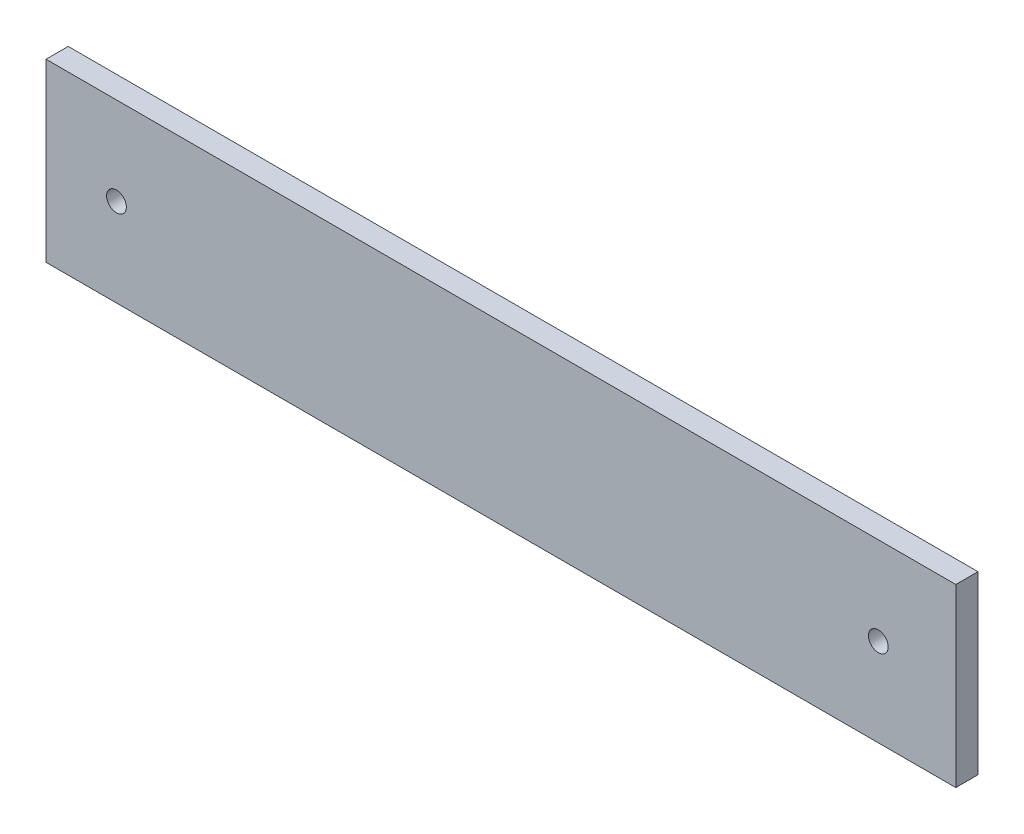
ISO-10303-21;
HEADER;
FILE_DESCRIPTION(('STEP AP214'),'2;1');
FILE_NAME('part.step','',(''),(''),'','','');
FILE_SCHEMA(('AUTOMOTIVE_DESIGN { 1 0 10303 214 1 1 1 1 }'));
ENDSEC;
DATA;
#1=APPLICATION_CONTEXT('core data for automotive mechanical design processes');
#2=APPLICATION_PROTOCOL_DEFINITION('international standard','automotive_design',2000,#1);
#3=PRODUCT_CONTEXT('',#1,'mechanical');
#4=PRODUCT('Part','Part','',(#3));
#5=PRODUCT_RELATED_PRODUCT_CATEGORY('part','',(#4));
#6=PRODUCT_DEFINITION_FORMATION('','',#4);
#7=PRODUCT_DEFINITION_CONTEXT('part definition',#1,'design');
#8=PRODUCT_DEFINITION('design','',#6,#7);
#9=PRODUCT_DEFINITION_SHAPE('','',#8);
#10=(LENGTH_UNIT() NAMED_UNIT(*) SI_UNIT(.MILLI.,.METRE.));
#11=(NAMED_UNIT(*) PLANE_ANGLE_UNIT() SI_UNIT($,.RADIAN.));
#12=(NAMED_UNIT(*) SI_UNIT($,.STERADIAN.) SOLID_ANGLE_UNIT());
#13=UNCERTAINTY_MEASURE_WITH_UNIT(LENGTH_MEASURE(1.E-05),#10,'distance_accuracy_value','');
#14=(GEOMETRIC_REPRESENTATION_CONTEXT(3) GLOBAL_UNCERTAINTY_ASSIGNED_CONTEXT((#13)) GLOBAL_UNIT_ASSIGNED_CONTEXT((#10,
#11,#12)) REPRESENTATION_CONTEXT('',''));
#15=CARTESIAN_POINT('',(0.,0.,0.));
#16=DIRECTION('',(0.,0.,1.));
#17=DIRECTION('',(1.,0.,0.));
#18=AXIS2_PLACEMENT_3D('',#15,#16,#17);
#19=CARTESIAN_POINT('',(0.,0.,3.175));
#20=DIRECTION('',(0.,0.,-1.));
#21=DIRECTION('',(-1.,0.,0.));
#22=AXIS2_PLACEMENT_3D('',#19,#20,#21);
#23=PLANE('',#22);
#24=DIRECTION('',(1.,0.,0.));
#25=VECTOR('',#24,1.);
#26=CARTESIAN_POINT('',(-59.4587820007596,-10.7110952514729,3.175));
#27=LINE('',#26,#25);
#28=CARTESIAN_POINT('',(-59.4587820007596,-10.7110952514729,3.175));
#29=VERTEX_POINT('',#28);
#30=CARTESIAN_POINT('',(70.7118676790634,-10.7110952514729,3.175));
#31=VERTEX_POINT('',#30);
#32=EDGE_CURVE('E92',#29,#31,#27,.T.);
#33=ORIENTED_EDGE('',*,*,#32,.T.);
#34=DIRECTION('',(0.,1.,0.));
#35=VECTOR('',#34,1.);
#36=CARTESIAN_POINT('',(70.7118676790634,14.4539265194652,3.175));
#37=LINE('',#36,#35);
#38=CARTESIAN_POINT('',(70.7118676790634,14.4539265194652,3.175));
#39=VERTEX_POINT('',#38);
#40=EDGE_CURVE('E87',#31,#39,#37,.T.);
#41=ORIENTED_EDGE('',*,*,#40,.T.);
#42=DIRECTION('',(-1.,0.,0.));
#43=VECTOR('',#42,1.);
#44=CARTESIAN_POINT('',(70.7118676790634,14.4539265194652,3.175));
#45=LINE('',#44,#43);
#46=CARTESIAN_POINT('',(-59.4587820007595,14.4539265194652,3.175));
#47=VERTEX_POINT('',#46);
#48=EDGE_CURVE('E90',#39,#47,#45,.T.);
#49=ORIENTED_EDGE('',*,*,#48,.T.);
#50=DIRECTION('',(0.,-1.,0.));
#51=VECTOR('',#50,1.);
#52=CARTESIAN_POINT('',(-59.4587820007595,14.4539265194652,3.175));
#53=LINE('',#52,#51);
#54=EDGE_CURVE('E57',#47,#29,#53,.T.);
#55=ORIENTED_EDGE('',*,*,#54,.T.);
#56=EDGE_LOOP('',(#33,#41,#49,#55));
#57=FACE_BOUND('',#56,.T.);
#58=CARTESIAN_POINT('',(-49.3749533966907,1.87499298888268,3.175));
#59=DIRECTION('',(0.,0.,1.));
#60=DIRECTION('',(1.,0.,0.));
#61=AXIS2_PLACEMENT_3D('',#58,#59,#60);
#62=CIRCLE('',#61,1.415);
#63=CARTESIAN_POINT('',(-47.9599533966907,1.87499298888268,3.175));
#64=VERTEX_POINT('',#63);
#65=EDGE_CURVE('E112',#64,#64,#62,.T.);
#66=ORIENTED_EDGE('',*,*,#65,.F.);
#67=EDGE_LOOP('',(#66));
#68=FACE_BOUND('',#67,.T.);
#69=CARTESIAN_POINT('',(59.6250466033093,1.87499298888268,3.175));
#70=DIRECTION('',(0.,0.,1.));
#71=DIRECTION('',(1.,0.,0.));
#72=AXIS2_PLACEMENT_3D('',#69,#70,#71);
#73=CIRCLE('',#72,1.415);
#74=CARTESIAN_POINT('',(61.0400466033093,1.87499298888268,3.175));
#75=VERTEX_POINT('',#74);
#76=EDGE_CURVE('E134',#75,#75,#73,.T.);
#77=ORIENTED_EDGE('',*,*,#76,.F.);
#78=EDGE_LOOP('',(#77));
#79=FACE_BOUND('',#78,.T.);
#80=ADVANCED_FACE('F39',(#57,#68,#79),#23,.F.);
#81=CARTESIAN_POINT('',(0.,0.,0.));
#82=DIRECTION('',(0.,0.,-1.));
#83=DIRECTION('',(-1.,0.,0.));
#84=AXIS2_PLACEMENT_3D('',#81,#82,#83);
#85=PLANE('',#84);
#86=CARTESIAN_POINT('',(-49.3749533966907,1.87499298888268,0.));
#87=DIRECTION('',(0.,0.,1.));
#88=DIRECTION('',(1.,0.,0.));
#89=AXIS2_PLACEMENT_3D('',#86,#87,#88);
#90=CIRCLE('',#89,1.415);
#91=CARTESIAN_POINT('',(-47.9599533966907,1.87499298888268,0.));
#92=VERTEX_POINT('',#91);
#93=EDGE_CURVE('E130',#92,#92,#90,.T.);
#94=ORIENTED_EDGE('',*,*,#93,.T.);
#95=EDGE_LOOP('',(#94));
#96=FACE_BOUND('',#95,.T.);
#97=DIRECTION('',(1.,0.,0.));
#98=VECTOR('',#97,1.);
#99=CARTESIAN_POINT('',(-59.4587820007596,-10.7110952514729,0.));
#100=LINE('',#99,#98);
#101=CARTESIAN_POINT('',(-59.4587820007596,-10.7110952514729,0.));
#102=VERTEX_POINT('',#101);
#103=CARTESIAN_POINT('',(70.7118676790634,-10.7110952514729,0.));
#104=VERTEX_POINT('',#103);
#105=EDGE_CURVE('E108',#102,#104,#100,.T.);
#106=ORIENTED_EDGE('',*,*,#105,.F.);
#107=DIRECTION('',(0.,-1.,0.));
#108=VECTOR('',#107,1.);
#109=CARTESIAN_POINT('',(-59.4587820007595,14.4539265194652,0.));
#110=LINE('',#109,#108);
#111=CARTESIAN_POINT('',(-59.4587820007595,14.4539265194652,0.));
#112=VERTEX_POINT('',#111);
#113=EDGE_CURVE('E80',#112,#102,#110,.T.);
#114=ORIENTED_EDGE('',*,*,#113,.F.);
#115=DIRECTION('',(-1.,0.,0.));
#116=VECTOR('',#115,1.);
#117=CARTESIAN_POINT('',(70.7118676790634,14.4539265194652,0.));
#118=LINE('',#117,#116);
#119=CARTESIAN_POINT('',(70.7118676790634,14.4539265194652,0.));
#120=VERTEX_POINT('',#119);
#121=EDGE_CURVE('E74',#120,#112,#118,.T.);
#122=ORIENTED_EDGE('',*,*,#121,.F.);
#123=DIRECTION('',(0.,1.,0.));
#124=VECTOR('',#123,1.);
#125=CARTESIAN_POINT('',(70.7118676790634,14.4539265194652,0.));
#126=LINE('',#125,#124);
#127=EDGE_CURVE('E97',#104,#120,#126,.T.);
#128=ORIENTED_EDGE('',*,*,#127,.F.);
#129=EDGE_LOOP('',(#106,#114,#122,#128));
#130=FACE_BOUND('',#129,.T.);
#131=CARTESIAN_POINT('',(59.6250466033093,1.87499298888268,0.));
#132=DIRECTION('',(0.,0.,1.));
#133=DIRECTION('',(1.,0.,0.));
#134=AXIS2_PLACEMENT_3D('',#131,#132,#133);
#135=CIRCLE('',#134,1.415);
#136=CARTESIAN_POINT('',(61.0400466033093,1.87499298888268,0.));
#137=VERTEX_POINT('',#136);
#138=EDGE_CURVE('E138',#137,#137,#135,.T.);
#139=ORIENTED_EDGE('',*,*,#138,.T.);
#140=EDGE_LOOP('',(#139));
#141=FACE_BOUND('',#140,.T.);
#142=ADVANCED_FACE('F125',(#96,#130,#141),#85,.T.);
#143=CARTESIAN_POINT('',(-59.4587820007596,-10.7110952514729,3.175));
#144=DIRECTION('',(0.,1.,0.));
#145=DIRECTION('',(0.,0.,1.));
#146=AXIS2_PLACEMENT_3D('',#143,#144,#145);
#147=PLANE('',#146);
#148=ORIENTED_EDGE('',*,*,#105,.T.);
#149=DIRECTION('',(0.,0.,-1.));
#150=VECTOR('',#149,1.);
#151=CARTESIAN_POINT('',(70.7118676790634,-10.7110952514729,3.175));
#152=LINE('',#151,#150);
#153=EDGE_CURVE('E11',#31,#104,#152,.T.);
#154=ORIENTED_EDGE('',*,*,#153,.F.);
#155=ORIENTED_EDGE('',*,*,#32,.F.);
#156=DIRECTION('',(0.,0.,-1.));
#157=VECTOR('',#156,1.);
#158=CARTESIAN_POINT('',(-59.4587820007596,-10.7110952514729,3.175));
#159=LINE('',#158,#157);
#160=EDGE_CURVE('E104',#29,#102,#159,.T.);
#161=ORIENTED_EDGE('',*,*,#160,.T.);
#162=EDGE_LOOP('',(#148,#154,#155,#161));
#163=FACE_BOUND('',#162,.T.);
#164=ADVANCED_FACE('F41',(#163),#147,.F.);
#165=CARTESIAN_POINT('',(70.7118676790634,14.4539265194652,3.175));
#166=DIRECTION('',(-1.,0.,0.));
#167=DIRECTION('',(0.,0.,1.));
#168=AXIS2_PLACEMENT_3D('',#165,#166,#167);
#169=PLANE('',#168);
#170=ORIENTED_EDGE('',*,*,#127,.T.);
#171=DIRECTION('',(0.,0.,-1.));
#172=VECTOR('',#171,1.);
#173=CARTESIAN_POINT('',(70.7118676790634,14.4539265194652,3.175));
#174=LINE('',#173,#172);
#175=EDGE_CURVE('E49',#39,#120,#174,.T.);
#176=ORIENTED_EDGE('',*,*,#175,.F.);
#177=ORIENTED_EDGE('',*,*,#40,.F.);
#178=ORIENTED_EDGE('',*,*,#153,.T.);
#179=EDGE_LOOP('',(#170,#176,#177,#178));
#180=FACE_BOUND('',#179,.T.);
#181=ADVANCED_FACE('F96',(#180),#169,.F.);
#182=CARTESIAN_POINT('',(70.7118676790634,14.4539265194652,3.175));
#183=DIRECTION('',(0.,-1.,0.));
#184=DIRECTION('',(0.,0.,-1.));
#185=AXIS2_PLACEMENT_3D('',#182,#183,#184);
#186=PLANE('',#185);
#187=ORIENTED_EDGE('',*,*,#121,.T.);
#188=DIRECTION('',(0.,0.,-1.));
#189=VECTOR('',#188,1.);
#190=CARTESIAN_POINT('',(-59.4587820007595,14.4539265194652,3.175));
#191=LINE('',#190,#189);
#192=EDGE_CURVE('E99',#47,#112,#191,.T.);
#193=ORIENTED_EDGE('',*,*,#192,.F.);
#194=ORIENTED_EDGE('',*,*,#48,.F.);
#195=ORIENTED_EDGE('',*,*,#175,.T.);
#196=EDGE_LOOP('',(#187,#193,#194,#195));
#197=FACE_BOUND('',#196,.T.);
#198=ADVANCED_FACE('F100',(#197),#186,.F.);
#199=CARTESIAN_POINT('',(-59.4587820007595,14.4539265194652,3.175));
#200=DIRECTION('',(1.,0.,0.));
#201=DIRECTION('',(0.,1.,0.));
#202=AXIS2_PLACEMENT_3D('',#199,#200,#201);
#203=PLANE('',#202);
#204=ORIENTED_EDGE('',*,*,#113,.T.);
#205=ORIENTED_EDGE('',*,*,#160,.F.);
#206=ORIENTED_EDGE('',*,*,#54,.F.);
#207=ORIENTED_EDGE('',*,*,#192,.T.);
#208=EDGE_LOOP('',(#204,#205,#206,#207));
#209=FACE_BOUND('',#208,.T.);
#210=ADVANCED_FACE('F122',(#209),#203,.F.);
#211=CARTESIAN_POINT('',(-49.3749533966907,1.87499298888268,3.175));
#212=DIRECTION('',(0.,0.,-1.));
#213=DIRECTION('',(-1.,0.,0.));
#214=AXIS2_PLACEMENT_3D('',#211,#212,#213);
#215=CYLINDRICAL_SURFACE('',#214,1.415);
#216=ORIENTED_EDGE('',*,*,#65,.T.);
#217=EDGE_LOOP('',(#216));
#218=FACE_BOUND('',#217,.T.);
#219=ORIENTED_EDGE('',*,*,#93,.F.);
#220=EDGE_LOOP('',(#219));
#221=FACE_BOUND('',#220,.T.);
#222=ADVANCED_FACE('F157',(#218,#221),#215,.F.);
#223=CARTESIAN_POINT('',(59.6250466033093,1.87499298888268,3.175));
#224=DIRECTION('',(0.,0.,-1.));
#225=DIRECTION('',(-1.,0.,0.));
#226=AXIS2_PLACEMENT_3D('',#223,#224,#225);
#227=CYLINDRICAL_SURFACE('',#226,1.415);
#228=ORIENTED_EDGE('',*,*,#76,.T.);
#229=EDGE_LOOP('',(#228));
#230=FACE_BOUND('',#229,.T.);
#231=ORIENTED_EDGE('',*,*,#138,.F.);
#232=EDGE_LOOP('',(#231));
#233=FACE_BOUND('',#232,.T.);
#234=ADVANCED_FACE('F146',(#230,#233),#227,.F.);
#235=CLOSED_SHELL('',(#80,#142,#164,#181,#198,#210,#222,#234));
#236=MANIFOLD_SOLID_BREP('B2',#235);
#237=ADVANCED_BREP_SHAPE_REPRESENTATION('',(#18,#236),#14);
#238=SHAPE_DEFINITION_REPRESENTATION(#9,#237);
ENDSEC;
END-ISO-10303-21;
